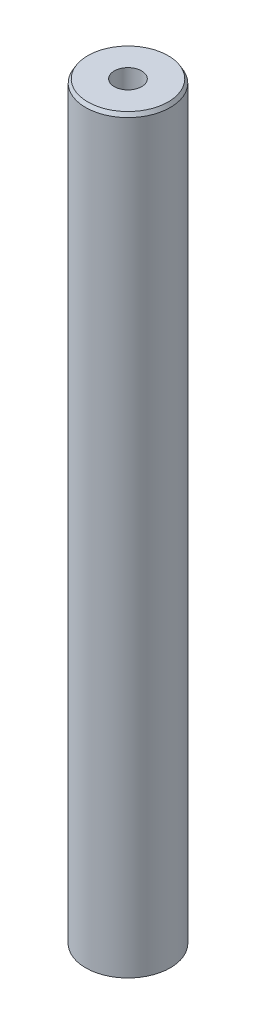
ISO-10303-21;
HEADER;
FILE_DESCRIPTION(('STEP AP214'),'2;1');
FILE_NAME('part.step','',(''),(''),'','','');
FILE_SCHEMA(('AUTOMOTIVE_DESIGN { 1 0 10303 214 1 1 1 1 }'));
ENDSEC;
DATA;
#1=APPLICATION_CONTEXT('core data for automotive mechanical design processes');
#2=APPLICATION_PROTOCOL_DEFINITION('international standard','automotive_design',2000,#1);
#3=PRODUCT_CONTEXT('',#1,'mechanical');
#4=PRODUCT('Part','Part','',(#3));
#5=PRODUCT_RELATED_PRODUCT_CATEGORY('part','',(#4));
#6=PRODUCT_DEFINITION_FORMATION('','',#4);
#7=PRODUCT_DEFINITION_CONTEXT('part definition',#1,'design');
#8=PRODUCT_DEFINITION('design','',#6,#7);
#9=PRODUCT_DEFINITION_SHAPE('','',#8);
#10=(LENGTH_UNIT() NAMED_UNIT(*) SI_UNIT(.MILLI.,.METRE.));
#11=(NAMED_UNIT(*) PLANE_ANGLE_UNIT() SI_UNIT($,.RADIAN.));
#12=(NAMED_UNIT(*) SI_UNIT($,.STERADIAN.) SOLID_ANGLE_UNIT());
#13=UNCERTAINTY_MEASURE_WITH_UNIT(LENGTH_MEASURE(1.E-05),#10,'distance_accuracy_value','');
#14=(GEOMETRIC_REPRESENTATION_CONTEXT(3) GLOBAL_UNCERTAINTY_ASSIGNED_CONTEXT((#13)) GLOBAL_UNIT_ASSIGNED_CONTEXT((#10,
#11,#12)) REPRESENTATION_CONTEXT('',''));
#15=CARTESIAN_POINT('',(0.,0.,0.));
#16=DIRECTION('',(0.,0.,1.));
#17=DIRECTION('',(1.,0.,0.));
#18=AXIS2_PLACEMENT_3D('',#15,#16,#17);
#19=CARTESIAN_POINT('',(0.,266.257905854735,0.));
#20=DIRECTION('',(0.,-1.,0.));
#21=DIRECTION('',(0.,0.,-1.));
#22=AXIS2_PLACEMENT_3D('',#19,#20,#21);
#23=CYLINDRICAL_SURFACE('',#22,15.);
#24=CARTESIAN_POINT('',(0.,264.938596863065,0.));
#25=DIRECTION('',(0.,1.,0.));
#26=DIRECTION('',(0.,0.,1.));
#27=AXIS2_PLACEMENT_3D('',#24,#25,#26);
#28=CIRCLE('',#27,15.);
#29=CARTESIAN_POINT('',(0.,264.938596863065,15.));
#30=VERTEX_POINT('',#29);
#31=EDGE_CURVE('E50',#30,#30,#28,.F.);
#32=ORIENTED_EDGE('',*,*,#31,.T.);
#33=EDGE_LOOP('',(#32));
#34=FACE_BOUND('',#33,.T.);
#35=CARTESIAN_POINT('',(0.,0.761703401485236,0.));
#36=DIRECTION('',(0.,1.,0.));
#37=DIRECTION('',(0.,0.,1.));
#38=AXIS2_PLACEMENT_3D('',#35,#36,#37);
#39=CIRCLE('',#38,15.);
#40=CARTESIAN_POINT('',(0.,0.761703401485236,15.));
#41=VERTEX_POINT('',#40);
#42=EDGE_CURVE('E51',#41,#41,#39,.T.);
#43=ORIENTED_EDGE('',*,*,#42,.T.);
#44=EDGE_LOOP('',(#43));
#45=FACE_BOUND('',#44,.T.);
#46=ADVANCED_FACE('F39',(#34,#45),#23,.T.);
#47=CARTESIAN_POINT('',(0.,266.257905854735,0.));
#48=DIRECTION('',(0.,1.,0.));
#49=DIRECTION('',(0.,0.,1.));
#50=AXIS2_PLACEMENT_3D('',#47,#48,#49);
#51=PLANE('',#50);
#52=CARTESIAN_POINT('',(0.,266.257905854735,0.));
#53=DIRECTION('',(0.,1.,0.));
#54=DIRECTION('',(0.,0.,1.));
#55=AXIS2_PLACEMENT_3D('',#52,#53,#54);
#56=CIRCLE('',#55,14.2382965985147);
#57=CARTESIAN_POINT('',(0.,266.257905854735,14.2382965985147));
#58=VERTEX_POINT('',#57);
#59=EDGE_CURVE('E54',#58,#58,#56,.T.);
#60=ORIENTED_EDGE('',*,*,#59,.T.);
#61=EDGE_LOOP('',(#60));
#62=FACE_BOUND('',#61,.T.);
#63=CARTESIAN_POINT('',(0.,266.257905854735,0.));
#64=DIRECTION('',(0.,1.,0.));
#65=DIRECTION('',(0.,0.,1.));
#66=AXIS2_PLACEMENT_3D('',#63,#64,#65);
#67=CIRCLE('',#66,4.85178119404638);
#68=CARTESIAN_POINT('',(0.,266.257905854735,4.85178119404638));
#69=VERTEX_POINT('',#68);
#70=EDGE_CURVE('E58',#69,#69,#67,.T.);
#71=ORIENTED_EDGE('',*,*,#70,.F.);
#72=EDGE_LOOP('',(#71));
#73=FACE_BOUND('',#72,.T.);
#74=ADVANCED_FACE('F69',(#62,#73),#51,.T.);
#75=CARTESIAN_POINT('',(0.,0.,0.));
#76=DIRECTION('',(0.,1.,0.));
#77=DIRECTION('',(0.,0.,1.));
#78=AXIS2_PLACEMENT_3D('',#75,#76,#77);
#79=PLANE('',#78);
#80=CARTESIAN_POINT('',(0.,0.,0.));
#81=DIRECTION('',(0.,1.,0.));
#82=DIRECTION('',(0.,0.,1.));
#83=AXIS2_PLACEMENT_3D('',#80,#81,#82);
#84=CIRCLE('',#83,13.6806910083295);
#85=CARTESIAN_POINT('',(0.,0.,13.6806910083295));
#86=VERTEX_POINT('',#85);
#87=EDGE_CURVE('E10',#86,#86,#84,.F.);
#88=ORIENTED_EDGE('',*,*,#87,.T.);
#89=EDGE_LOOP('',(#88));
#90=FACE_BOUND('',#89,.T.);
#91=CARTESIAN_POINT('',(0.,0.,0.));
#92=DIRECTION('',(0.,1.,0.));
#93=DIRECTION('',(0.,0.,1.));
#94=AXIS2_PLACEMENT_3D('',#91,#92,#93);
#95=CIRCLE('',#94,4.85178119404638);
#96=CARTESIAN_POINT('',(0.,0.,4.85178119404638));
#97=VERTEX_POINT('',#96);
#98=EDGE_CURVE('E63',#97,#97,#95,.T.);
#99=ORIENTED_EDGE('',*,*,#98,.T.);
#100=EDGE_LOOP('',(#99));
#101=FACE_BOUND('',#100,.T.);
#102=ADVANCED_FACE('F75',(#90,#101),#79,.F.);
#103=CARTESIAN_POINT('',(0.,266.257905854735,0.));
#104=DIRECTION('',(0.,-1.,0.));
#105=DIRECTION('',(0.,0.,-1.));
#106=AXIS2_PLACEMENT_3D('',#103,#104,#105);
#107=CYLINDRICAL_SURFACE('',#106,4.85178119404638);
#108=ORIENTED_EDGE('',*,*,#70,.T.);
#109=EDGE_LOOP('',(#108));
#110=FACE_BOUND('',#109,.T.);
#111=ORIENTED_EDGE('',*,*,#98,.F.);
#112=EDGE_LOOP('',(#111));
#113=FACE_BOUND('',#112,.T.);
#114=ADVANCED_FACE('F70',(#110,#113),#107,.F.);
#115=CARTESIAN_POINT('',(0.,266.257905854735,0.));
#116=DIRECTION('',(0.,-1.,0.));
#117=DIRECTION('',(0.,0.,-1.));
#118=AXIS2_PLACEMENT_3D('',#115,#116,#117);
#119=CONICAL_SURFACE('',#118,14.2382965985147,0.523598775598281);
#120=ORIENTED_EDGE('',*,*,#31,.F.);
#121=EDGE_LOOP('',(#120));
#122=FACE_BOUND('',#121,.T.);
#123=ORIENTED_EDGE('',*,*,#59,.F.);
#124=EDGE_LOOP('',(#123));
#125=FACE_BOUND('',#124,.T.);
#126=ADVANCED_FACE('F81',(#122,#125),#119,.T.);
#127=CARTESIAN_POINT('',(0.,0.761703401485236,0.));
#128=DIRECTION('',(0.,1.,0.));
#129=DIRECTION('',(0.,0.,1.));
#130=AXIS2_PLACEMENT_3D('',#127,#128,#129);
#131=CONICAL_SURFACE('',#130,15.,1.0471975511966);
#132=ORIENTED_EDGE('',*,*,#87,.F.);
#133=EDGE_LOOP('',(#132));
#134=FACE_BOUND('',#133,.T.);
#135=ORIENTED_EDGE('',*,*,#42,.F.);
#136=EDGE_LOOP('',(#135));
#137=FACE_BOUND('',#136,.T.);
#138=ADVANCED_FACE('F45',(#134,#137),#131,.T.);
#139=CLOSED_SHELL('',(#46,#74,#102,#114,#126,#138));
#140=MANIFOLD_SOLID_BREP('B2',#139);
#141=ADVANCED_BREP_SHAPE_REPRESENTATION('',(#18,#140),#14);
#142=SHAPE_DEFINITION_REPRESENTATION(#9,#141);
ENDSEC;
END-ISO-10303-21;
